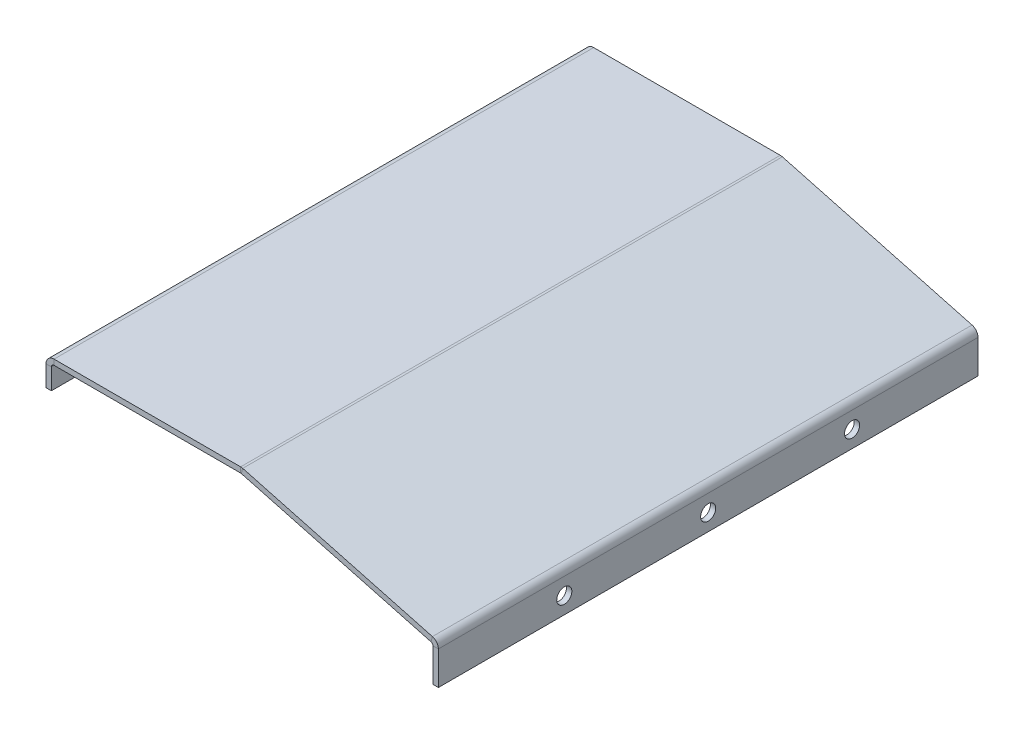
ISO-10303-21;
HEADER;
FILE_DESCRIPTION(('STEP AP214'),'2;1');
FILE_NAME('part.step','',(''),(''),'','','');
FILE_SCHEMA(('AUTOMOTIVE_DESIGN { 1 0 10303 214 1 1 1 1 }'));
ENDSEC;
DATA;
#1=APPLICATION_CONTEXT('core data for automotive mechanical design processes');
#2=APPLICATION_PROTOCOL_DEFINITION('international standard','automotive_design',2000,#1);
#3=PRODUCT_CONTEXT('',#1,'mechanical');
#4=PRODUCT('Part','Part','',(#3));
#5=PRODUCT_RELATED_PRODUCT_CATEGORY('part','',(#4));
#6=PRODUCT_DEFINITION_FORMATION('','',#4);
#7=PRODUCT_DEFINITION_CONTEXT('part definition',#1,'design');
#8=PRODUCT_DEFINITION('design','',#6,#7);
#9=PRODUCT_DEFINITION_SHAPE('','',#8);
#10=(LENGTH_UNIT() NAMED_UNIT(*) SI_UNIT(.MILLI.,.METRE.));
#11=(NAMED_UNIT(*) PLANE_ANGLE_UNIT() SI_UNIT($,.RADIAN.));
#12=(NAMED_UNIT(*) SI_UNIT($,.STERADIAN.) SOLID_ANGLE_UNIT());
#13=UNCERTAINTY_MEASURE_WITH_UNIT(LENGTH_MEASURE(1.E-05),#10,'distance_accuracy_value','');
#14=(GEOMETRIC_REPRESENTATION_CONTEXT(3) GLOBAL_UNCERTAINTY_ASSIGNED_CONTEXT((#13)) GLOBAL_UNIT_ASSIGNED_CONTEXT((#10,
#11,#12)) REPRESENTATION_CONTEXT('',''));
#15=CARTESIAN_POINT('',(0.,0.,0.));
#16=DIRECTION('',(0.,0.,1.));
#17=DIRECTION('',(1.,0.,0.));
#18=AXIS2_PLACEMENT_3D('',#15,#16,#17);
#19=CARTESIAN_POINT('',(54.5926736099192,-0.0511112605663946,150.));
#20=DIRECTION('',(0.,0.,1.));
#21=DIRECTION('',(1.,0.,0.));
#22=AXIS2_PLACEMENT_3D('',#19,#20,#21);
#23=PLANE('',#22);
#24=DIRECTION('',(0.96592582628907,-0.258819045102515,0.));
#25=VECTOR('',#24,1.);
#26=CARTESIAN_POINT('',(-2.15131707126789,13.6004809471613,150.));
#27=LINE('',#26,#25);
#28=CARTESIAN_POINT('',(107.025513428092,-15.6533626173311,150.));
#29=VERTEX_POINT('',#28);
#30=CARTESIAN_POINT('',(54.2981159211651,-1.52509903635547,150.));
#31=VERTEX_POINT('',#30);
#32=EDGE_CURVE('E350',#29,#31,#27,.F.);
#33=ORIENTED_EDGE('',*,*,#32,.F.);
#34=DIRECTION('',(0.258819045102519,0.965925826289069,0.));
#35=VECTOR('',#34,1.);
#36=CARTESIAN_POINT('',(107.025513428092,-15.6533626173311,150.));
#37=LINE('',#36,#35);
#38=CARTESIAN_POINT('',(107.413741995746,-14.2044738778975,150.));
#39=VERTEX_POINT('',#38);
#40=EDGE_CURVE('E268',#29,#39,#37,.T.);
#41=ORIENTED_EDGE('',*,*,#40,.T.);
#42=DIRECTION('',(-0.96592582628907,0.258819045102515,0.));
#43=VECTOR('',#42,1.);
#44=CARTESIAN_POINT('',(54.5926736099192,-0.0511112605663912,150.));
#45=LINE('',#44,#43);
#46=CARTESIAN_POINT('',(54.6863444888188,-0.0762102969218588,150.));
#47=VERTEX_POINT('',#46);
#48=EDGE_CURVE('E344',#39,#47,#45,.T.);
#49=ORIENTED_EDGE('',*,*,#48,.T.);
#50=DIRECTION('',(0.258819045102515,0.96592582628907,0.));
#51=VECTOR('',#50,1.);
#52=CARTESIAN_POINT('',(54.2981159211651,-1.52509903635547,150.));
#53=LINE('',#52,#51);
#54=EDGE_CURVE('E358',#31,#47,#53,.T.);
#55=ORIENTED_EDGE('',*,*,#54,.F.);
#56=EDGE_LOOP('',(#33,#41,#49,#55));
#57=FACE_BOUND('',#56,.T.);
#58=ADVANCED_FACE('F98',(#57),#23,.T.);
#59=CARTESIAN_POINT('',(-1.76308850361412,15.0493696865949,0.));
#60=DIRECTION('',(0.258819045102515,0.96592582628907,0.));
#61=DIRECTION('',(-0.96592582628907,0.258819045102515,0.));
#62=AXIS2_PLACEMENT_3D('',#59,#60,#61);
#63=PLANE('',#62);
#64=ORIENTED_EDGE('',*,*,#48,.F.);
#65=DIRECTION('',(0.,0.,1.));
#66=VECTOR('',#65,1.);
#67=CARTESIAN_POINT('',(107.413741995746,-14.2044738778975,150.));
#68=LINE('',#67,#66);
#69=CARTESIAN_POINT('',(107.413741995746,-14.2044738778974,0.));
#70=VERTEX_POINT('',#69);
#71=EDGE_CURVE('E218',#39,#70,#68,.F.);
#72=ORIENTED_EDGE('',*,*,#71,.T.);
#73=DIRECTION('',(0.96592582628907,-0.258819045102515,0.));
#74=VECTOR('',#73,1.);
#75=CARTESIAN_POINT('',(109.459695887124,-14.7526855708433,0.));
#76=LINE('',#75,#74);
#77=CARTESIAN_POINT('',(54.6863444888189,-0.076210296921861,0.));
#78=VERTEX_POINT('',#77);
#79=EDGE_CURVE('E347',#78,#70,#76,.T.);
#80=ORIENTED_EDGE('',*,*,#79,.F.);
#81=DIRECTION('',(0.,0.,1.));
#82=VECTOR('',#81,1.);
#83=CARTESIAN_POINT('',(54.6863444888189,-0.0762102969218605,0.));
#84=LINE('',#83,#82);
#85=EDGE_CURVE('E355',#78,#47,#84,.T.);
#86=ORIENTED_EDGE('',*,*,#85,.T.);
#87=EDGE_LOOP('',(#64,#72,#80,#86));
#88=FACE_BOUND('',#87,.T.);
#89=ADVANCED_FACE('F419',(#88),#63,.T.);
#90=CARTESIAN_POINT('',(-2.15131707126789,13.6004809471613,0.));
#91=DIRECTION('',(0.258819045102515,0.96592582628907,0.));
#92=DIRECTION('',(-0.96592582628907,0.258819045102515,0.));
#93=AXIS2_PLACEMENT_3D('',#90,#91,#92);
#94=PLANE('',#93);
#95=DIRECTION('',(0.,0.,1.));
#96=VECTOR('',#95,1.);
#97=CARTESIAN_POINT('',(107.025513428092,-15.6533626173311,150.));
#98=LINE('',#97,#96);
#99=CARTESIAN_POINT('',(107.025513428092,-15.6533626173311,0.));
#100=VERTEX_POINT('',#99);
#101=EDGE_CURVE('E272',#29,#100,#98,.F.);
#102=ORIENTED_EDGE('',*,*,#101,.F.);
#103=ORIENTED_EDGE('',*,*,#32,.T.);
#104=DIRECTION('',(0.,0.,-1.));
#105=VECTOR('',#104,1.);
#106=CARTESIAN_POINT('',(54.2981159211651,-1.52509903635547,0.));
#107=LINE('',#106,#105);
#108=CARTESIAN_POINT('',(54.2981159211651,-1.52509903635547,0.));
#109=VERTEX_POINT('',#108);
#110=EDGE_CURVE('E361',#109,#31,#107,.F.);
#111=ORIENTED_EDGE('',*,*,#110,.F.);
#112=DIRECTION('',(-0.96592582628907,0.258819045102515,0.));
#113=VECTOR('',#112,1.);
#114=CARTESIAN_POINT('',(-2.15131707126789,13.6004809471613,0.));
#115=LINE('',#114,#113);
#116=EDGE_CURVE('E352',#109,#100,#115,.F.);
#117=ORIENTED_EDGE('',*,*,#116,.T.);
#118=EDGE_LOOP('',(#102,#103,#111,#117));
#119=FACE_BOUND('',#118,.T.);
#120=ADVANCED_FACE('F425',(#119),#94,.F.);
#121=CARTESIAN_POINT('',(0.,-1.5,150.));
#122=DIRECTION('',(0.,1.,0.));
#123=DIRECTION('',(0.,0.,1.));
#124=AXIS2_PLACEMENT_3D('',#121,#122,#123);
#125=PLANE('',#124);
#126=DIRECTION('',(0.,0.,-1.));
#127=VECTOR('',#126,1.);
#128=CARTESIAN_POINT('',(2.2366,-1.5,0.));
#129=LINE('',#128,#127);
#130=CARTESIAN_POINT('',(2.2366,-1.5,0.));
#131=VERTEX_POINT('',#130);
#132=CARTESIAN_POINT('',(2.2366,-1.5,150.));
#133=VERTEX_POINT('',#132);
#134=EDGE_CURVE('E335',#131,#133,#129,.F.);
#135=ORIENTED_EDGE('',*,*,#134,.F.);
#136=DIRECTION('',(1.,0.,0.));
#137=VECTOR('',#136,1.);
#138=CARTESIAN_POINT('',(0.,-1.5,0.));
#139=LINE('',#138,#137);
#140=CARTESIAN_POINT('',(54.1074698125426,-1.49999999999999,0.));
#141=VERTEX_POINT('',#140);
#142=EDGE_CURVE('E387',#131,#141,#139,.T.);
#143=ORIENTED_EDGE('',*,*,#142,.T.);
#144=DIRECTION('',(0.,0.,1.));
#145=VECTOR('',#144,1.);
#146=CARTESIAN_POINT('',(54.1074698125426,-1.49999999999999,150.));
#147=LINE('',#146,#145);
#148=CARTESIAN_POINT('',(54.1074698125426,-1.49999999999999,150.));
#149=VERTEX_POINT('',#148);
#150=EDGE_CURVE('E379',#149,#141,#147,.F.);
#151=ORIENTED_EDGE('',*,*,#150,.F.);
#152=DIRECTION('',(1.,0.,0.));
#153=VECTOR('',#152,1.);
#154=CARTESIAN_POINT('',(0.,-1.5,150.));
#155=LINE('',#154,#153);
#156=EDGE_CURVE('E107',#133,#149,#155,.T.);
#157=ORIENTED_EDGE('',*,*,#156,.F.);
#158=EDGE_LOOP('',(#135,#143,#151,#157));
#159=FACE_BOUND('',#158,.T.);
#160=ADVANCED_FACE('F100',(#159),#125,.F.);
#161=CARTESIAN_POINT('',(0.,0.,150.));
#162=DIRECTION('',(0.,1.,0.));
#163=DIRECTION('',(0.,0.,1.));
#164=AXIS2_PLACEMENT_3D('',#161,#162,#163);
#165=PLANE('',#164);
#166=DIRECTION('',(1.,0.,0.));
#167=VECTOR('',#166,1.);
#168=CARTESIAN_POINT('',(0.,0.,0.));
#169=LINE('',#168,#167);
#170=CARTESIAN_POINT('',(2.2366,0.,0.));
#171=VERTEX_POINT('',#170);
#172=CARTESIAN_POINT('',(54.1074698125426,0.,0.));
#173=VERTEX_POINT('',#172);
#174=EDGE_CURVE('E123',#171,#173,#169,.T.);
#175=ORIENTED_EDGE('',*,*,#174,.F.);
#176=DIRECTION('',(0.,0.,-1.));
#177=VECTOR('',#176,1.);
#178=CARTESIAN_POINT('',(2.2366,0.,0.));
#179=LINE('',#178,#177);
#180=CARTESIAN_POINT('',(2.2366,0.,150.));
#181=VERTEX_POINT('',#180);
#182=EDGE_CURVE('E322',#171,#181,#179,.F.);
#183=ORIENTED_EDGE('',*,*,#182,.T.);
#184=DIRECTION('',(1.,0.,0.));
#185=VECTOR('',#184,1.);
#186=CARTESIAN_POINT('',(0.,0.,150.));
#187=LINE('',#186,#185);
#188=CARTESIAN_POINT('',(54.1074698125426,0.,150.));
#189=VERTEX_POINT('',#188);
#190=EDGE_CURVE('E13',#181,#189,#187,.T.);
#191=ORIENTED_EDGE('',*,*,#190,.T.);
#192=DIRECTION('',(0.,0.,1.));
#193=VECTOR('',#192,1.);
#194=CARTESIAN_POINT('',(54.1074698125426,0.,150.));
#195=LINE('',#194,#193);
#196=EDGE_CURVE('E366',#189,#173,#195,.F.);
#197=ORIENTED_EDGE('',*,*,#196,.T.);
#198=EDGE_LOOP('',(#175,#183,#191,#197));
#199=FACE_BOUND('',#198,.T.);
#200=ADVANCED_FACE('F456',(#199),#165,.T.);
#201=CARTESIAN_POINT('',(0.,0.,150.));
#202=DIRECTION('',(0.,0.,-1.));
#203=DIRECTION('',(-1.,0.,0.));
#204=AXIS2_PLACEMENT_3D('',#201,#202,#203);
#205=PLANE('',#204);
#206=DIRECTION('',(0.,1.,0.));
#207=VECTOR('',#206,1.);
#208=CARTESIAN_POINT('',(2.2366,-1.5,150.));
#209=LINE('',#208,#207);
#210=EDGE_CURVE('E339',#133,#181,#209,.T.);
#211=ORIENTED_EDGE('',*,*,#210,.F.);
#212=ORIENTED_EDGE('',*,*,#156,.T.);
#213=DIRECTION('',(0.,1.,0.));
#214=VECTOR('',#213,1.);
#215=CARTESIAN_POINT('',(54.1074698125426,-1.49999999999999,150.));
#216=LINE('',#215,#214);
#217=EDGE_CURVE('E373',#149,#189,#216,.T.);
#218=ORIENTED_EDGE('',*,*,#217,.T.);
#219=ORIENTED_EDGE('',*,*,#190,.F.);
#220=EDGE_LOOP('',(#211,#212,#218,#219));
#221=FACE_BOUND('',#220,.T.);
#222=ADVANCED_FACE('F453',(#221),#205,.F.);
#223=CARTESIAN_POINT('',(0.,0.,0.));
#224=DIRECTION('',(0.,0.,-1.));
#225=DIRECTION('',(-1.,0.,0.));
#226=AXIS2_PLACEMENT_3D('',#223,#224,#225);
#227=PLANE('',#226);
#228=ORIENTED_EDGE('',*,*,#142,.F.);
#229=DIRECTION('',(0.,1.,0.));
#230=VECTOR('',#229,1.);
#231=CARTESIAN_POINT('',(2.2366,-1.5,0.));
#232=LINE('',#231,#230);
#233=EDGE_CURVE('E329',#131,#171,#232,.T.);
#234=ORIENTED_EDGE('',*,*,#233,.T.);
#235=ORIENTED_EDGE('',*,*,#174,.T.);
#236=DIRECTION('',(0.,1.,0.));
#237=VECTOR('',#236,1.);
#238=CARTESIAN_POINT('',(54.1074698125426,-1.49999999999999,0.));
#239=LINE('',#238,#237);
#240=EDGE_CURVE('E384',#141,#173,#239,.T.);
#241=ORIENTED_EDGE('',*,*,#240,.F.);
#242=EDGE_LOOP('',(#228,#234,#235,#241));
#243=FACE_BOUND('',#242,.T.);
#244=ADVANCED_FACE('F448',(#243),#227,.T.);
#245=CARTESIAN_POINT('',(54.1074698125426,-2.23660000000001,0.));
#246=DIRECTION('',(0.,0.,-1.));
#247=DIRECTION('',(-1.,0.,0.));
#248=AXIS2_PLACEMENT_3D('',#245,#246,#247);
#249=PLANE('',#248);
#250=DIRECTION('',(0.258819045102515,0.96592582628907,0.));
#251=VECTOR('',#250,1.);
#252=CARTESIAN_POINT('',(54.6863444888188,-0.076210296921864,0.));
#253=LINE('',#252,#251);
#254=EDGE_CURVE('E342',#109,#78,#253,.T.);
#255=ORIENTED_EDGE('',*,*,#254,.F.);
#256=CARTESIAN_POINT('',(54.1074698125426,-2.23660000000001,0.));
#257=DIRECTION('',(0.,0.,1.));
#258=DIRECTION('',(1.,0.,0.));
#259=AXIS2_PLACEMENT_3D('',#256,#257,#258);
#260=CIRCLE('',#259,0.736600000000016);
#261=EDGE_CURVE('E376',#141,#109,#260,.F.);
#262=ORIENTED_EDGE('',*,*,#261,.F.);
#263=ORIENTED_EDGE('',*,*,#240,.T.);
#264=CARTESIAN_POINT('',(54.1074698125426,-2.23660000000001,0.));
#265=DIRECTION('',(0.,0.,1.));
#266=DIRECTION('',(1.,0.,0.));
#267=AXIS2_PLACEMENT_3D('',#264,#265,#266);
#268=CIRCLE('',#267,2.23660000000002);
#269=EDGE_CURVE('E369',#173,#78,#268,.F.);
#270=ORIENTED_EDGE('',*,*,#269,.T.);
#271=EDGE_LOOP('',(#255,#262,#263,#270));
#272=FACE_BOUND('',#271,.T.);
#273=ADVANCED_FACE('F445',(#272),#249,.T.);
#274=CARTESIAN_POINT('',(54.1074698125426,-2.23660000000001,150.));
#275=DIRECTION('',(0.,0.,-1.));
#276=DIRECTION('',(-1.,0.,0.));
#277=AXIS2_PLACEMENT_3D('',#274,#275,#276);
#278=PLANE('',#277);
#279=CARTESIAN_POINT('',(54.1074698125426,-2.23660000000001,150.));
#280=DIRECTION('',(0.,0.,1.));
#281=DIRECTION('',(1.,0.,0.));
#282=AXIS2_PLACEMENT_3D('',#279,#280,#281);
#283=CIRCLE('',#282,0.736600000000016);
#284=EDGE_CURVE('E346',#31,#149,#283,.T.);
#285=ORIENTED_EDGE('',*,*,#284,.F.);
#286=ORIENTED_EDGE('',*,*,#54,.T.);
#287=CARTESIAN_POINT('',(54.1074698125426,-2.23660000000001,150.));
#288=DIRECTION('',(0.,0.,1.));
#289=DIRECTION('',(1.,0.,0.));
#290=AXIS2_PLACEMENT_3D('',#287,#288,#289);
#291=CIRCLE('',#290,2.23660000000002);
#292=EDGE_CURVE('E370',#47,#189,#291,.T.);
#293=ORIENTED_EDGE('',*,*,#292,.T.);
#294=ORIENTED_EDGE('',*,*,#217,.F.);
#295=EDGE_LOOP('',(#285,#286,#293,#294));
#296=FACE_BOUND('',#295,.T.);
#297=ADVANCED_FACE('F440',(#296),#278,.F.);
#298=CARTESIAN_POINT('',(54.1074698125426,-2.23660000000001,150.));
#299=DIRECTION('',(0.,0.,1.));
#300=DIRECTION('',(0.258819045102515,0.96592582628907,0.));
#301=AXIS2_PLACEMENT_3D('',#298,#299,#300);
#302=CYLINDRICAL_SURFACE('',#301,2.23660000000002);
#303=ORIENTED_EDGE('',*,*,#196,.F.);
#304=ORIENTED_EDGE('',*,*,#292,.F.);
#305=ORIENTED_EDGE('',*,*,#85,.F.);
#306=ORIENTED_EDGE('',*,*,#269,.F.);
#307=EDGE_LOOP('',(#303,#304,#305,#306));
#308=FACE_BOUND('',#307,.T.);
#309=ADVANCED_FACE('F437',(#308),#302,.T.);
#310=CARTESIAN_POINT('',(54.1074698125426,-2.23660000000001,150.));
#311=DIRECTION('',(0.,0.,1.));
#312=DIRECTION('',(0.258819045102515,0.96592582628907,0.));
#313=AXIS2_PLACEMENT_3D('',#310,#311,#312);
#314=CYLINDRICAL_SURFACE('',#313,0.736600000000016);
#315=ORIENTED_EDGE('',*,*,#150,.T.);
#316=ORIENTED_EDGE('',*,*,#261,.T.);
#317=ORIENTED_EDGE('',*,*,#110,.T.);
#318=ORIENTED_EDGE('',*,*,#284,.T.);
#319=EDGE_LOOP('',(#315,#316,#317,#318));
#320=FACE_BOUND('',#319,.T.);
#321=ADVANCED_FACE('F435',(#320),#314,.F.);
#322=CARTESIAN_POINT('',(109.459695887124,-14.7526855708433,0.));
#323=DIRECTION('',(0.,0.,-1.));
#324=DIRECTION('',(-1.,0.,0.));
#325=AXIS2_PLACEMENT_3D('',#322,#323,#324);
#326=PLANE('',#325);
#327=DIRECTION('',(0.258819045102519,0.965925826289069,0.));
#328=VECTOR('',#327,1.);
#329=CARTESIAN_POINT('',(107.025513428092,-15.6533626173311,0.));
#330=LINE('',#329,#328);
#331=EDGE_CURVE('E275',#100,#70,#330,.T.);
#332=ORIENTED_EDGE('',*,*,#331,.F.);
#333=ORIENTED_EDGE('',*,*,#116,.F.);
#334=ORIENTED_EDGE('',*,*,#254,.T.);
#335=ORIENTED_EDGE('',*,*,#79,.T.);
#336=EDGE_LOOP('',(#332,#333,#334,#335));
#337=FACE_BOUND('',#336,.T.);
#338=ADVANCED_FACE('F431',(#337),#326,.T.);
#339=CARTESIAN_POINT('',(2.2366,-2.2366,150.));
#340=DIRECTION('',(0.,0.,1.));
#341=DIRECTION('',(1.,0.,0.));
#342=AXIS2_PLACEMENT_3D('',#339,#340,#341);
#343=PLANE('',#342);
#344=DIRECTION('',(-1.,0.,0.));
#345=VECTOR('',#344,1.);
#346=CARTESIAN_POINT('',(0.,-2.23659999999999,150.));
#347=LINE('',#346,#345);
#348=CARTESIAN_POINT('',(1.5,-2.2366,150.));
#349=VERTEX_POINT('',#348);
#350=CARTESIAN_POINT('',(0.,-2.23659999999999,150.));
#351=VERTEX_POINT('',#350);
#352=EDGE_CURVE('E319',#349,#351,#347,.T.);
#353=ORIENTED_EDGE('',*,*,#352,.F.);
#354=CARTESIAN_POINT('',(2.2366,-2.2366,150.));
#355=DIRECTION('',(0.,0.,-1.));
#356=DIRECTION('',(-1.,0.,0.));
#357=AXIS2_PLACEMENT_3D('',#354,#355,#356);
#358=CIRCLE('',#357,0.7366);
#359=EDGE_CURVE('E332',#133,#349,#358,.F.);
#360=ORIENTED_EDGE('',*,*,#359,.F.);
#361=ORIENTED_EDGE('',*,*,#210,.T.);
#362=CARTESIAN_POINT('',(2.2366,-2.2366,150.));
#363=DIRECTION('',(0.,0.,-1.));
#364=DIRECTION('',(-1.,0.,0.));
#365=AXIS2_PLACEMENT_3D('',#362,#363,#364);
#366=CIRCLE('',#365,2.2366);
#367=EDGE_CURVE('E325',#181,#351,#366,.F.);
#368=ORIENTED_EDGE('',*,*,#367,.T.);
#369=EDGE_LOOP('',(#353,#360,#361,#368));
#370=FACE_BOUND('',#369,.T.);
#371=ADVANCED_FACE('F434',(#370),#343,.T.);
#372=CARTESIAN_POINT('',(2.2366,-2.2366,0.));
#373=DIRECTION('',(0.,0.,1.));
#374=DIRECTION('',(1.,0.,0.));
#375=AXIS2_PLACEMENT_3D('',#372,#373,#374);
#376=PLANE('',#375);
#377=CARTESIAN_POINT('',(2.2366,-2.2366,0.));
#378=DIRECTION('',(0.,0.,-1.));
#379=DIRECTION('',(-1.,0.,0.));
#380=AXIS2_PLACEMENT_3D('',#377,#378,#379);
#381=CIRCLE('',#380,0.7366);
#382=CARTESIAN_POINT('',(1.5,-2.2366,0.));
#383=VERTEX_POINT('',#382);
#384=EDGE_CURVE('E291',#383,#131,#381,.T.);
#385=ORIENTED_EDGE('',*,*,#384,.F.);
#386=DIRECTION('',(-1.,0.,0.));
#387=VECTOR('',#386,1.);
#388=CARTESIAN_POINT('',(1.5,-2.2366,0.));
#389=LINE('',#388,#387);
#390=CARTESIAN_POINT('',(0.,-2.23659999999999,0.));
#391=VERTEX_POINT('',#390);
#392=EDGE_CURVE('E314',#383,#391,#389,.T.);
#393=ORIENTED_EDGE('',*,*,#392,.T.);
#394=CARTESIAN_POINT('',(2.2366,-2.2366,0.));
#395=DIRECTION('',(0.,0.,-1.));
#396=DIRECTION('',(-1.,0.,0.));
#397=AXIS2_PLACEMENT_3D('',#394,#395,#396);
#398=CIRCLE('',#397,2.2366);
#399=EDGE_CURVE('E326',#391,#171,#398,.T.);
#400=ORIENTED_EDGE('',*,*,#399,.T.);
#401=ORIENTED_EDGE('',*,*,#233,.F.);
#402=EDGE_LOOP('',(#385,#393,#400,#401));
#403=FACE_BOUND('',#402,.T.);
#404=ADVANCED_FACE('F480',(#403),#376,.F.);
#405=CARTESIAN_POINT('',(2.2366,-2.2366,0.));
#406=DIRECTION('',(0.,0.,-1.));
#407=DIRECTION('',(-1.,0.,0.));
#408=AXIS2_PLACEMENT_3D('',#405,#406,#407);
#409=CYLINDRICAL_SURFACE('',#408,2.2366);
#410=ORIENTED_EDGE('',*,*,#182,.F.);
#411=ORIENTED_EDGE('',*,*,#399,.F.);
#412=DIRECTION('',(0.,0.,-1.));
#413=VECTOR('',#412,1.);
#414=CARTESIAN_POINT('',(0.,-2.23659999999999,0.));
#415=LINE('',#414,#413);
#416=EDGE_CURVE('E311',#351,#391,#415,.T.);
#417=ORIENTED_EDGE('',*,*,#416,.F.);
#418=ORIENTED_EDGE('',*,*,#367,.F.);
#419=EDGE_LOOP('',(#410,#411,#417,#418));
#420=FACE_BOUND('',#419,.T.);
#421=ADVANCED_FACE('F503',(#420),#409,.T.);
#422=CARTESIAN_POINT('',(2.2366,-2.2366,0.));
#423=DIRECTION('',(0.,0.,-1.));
#424=DIRECTION('',(-1.,0.,0.));
#425=AXIS2_PLACEMENT_3D('',#422,#423,#424);
#426=CYLINDRICAL_SURFACE('',#425,0.7366);
#427=ORIENTED_EDGE('',*,*,#134,.T.);
#428=ORIENTED_EDGE('',*,*,#359,.T.);
#429=DIRECTION('',(0.,0.,1.));
#430=VECTOR('',#429,1.);
#431=CARTESIAN_POINT('',(1.5,-2.2366,150.));
#432=LINE('',#431,#430);
#433=EDGE_CURVE('E317',#349,#383,#432,.F.);
#434=ORIENTED_EDGE('',*,*,#433,.T.);
#435=ORIENTED_EDGE('',*,*,#384,.T.);
#436=EDGE_LOOP('',(#427,#428,#434,#435));
#437=FACE_BOUND('',#436,.T.);
#438=ADVANCED_FACE('F482',(#437),#426,.F.);
#439=CARTESIAN_POINT('',(0.,-1.49999999999999,0.));
#440=DIRECTION('',(0.,0.,-1.));
#441=DIRECTION('',(-1.,0.,0.));
#442=AXIS2_PLACEMENT_3D('',#439,#440,#441);
#443=PLANE('',#442);
#444=DIRECTION('',(0.,1.,0.));
#445=VECTOR('',#444,1.);
#446=CARTESIAN_POINT('',(0.,-1.49999999999999,0.));
#447=LINE('',#446,#445);
#448=CARTESIAN_POINT('',(0.,-8.,0.));
#449=VERTEX_POINT('',#448);
#450=EDGE_CURVE('E295',#449,#391,#447,.T.);
#451=ORIENTED_EDGE('',*,*,#450,.T.);
#452=ORIENTED_EDGE('',*,*,#392,.F.);
#453=DIRECTION('',(0.,-1.,0.));
#454=VECTOR('',#453,1.);
#455=CARTESIAN_POINT('',(1.50000000000001,0.,0.));
#456=LINE('',#455,#454);
#457=CARTESIAN_POINT('',(1.49999999999998,-8.00000000000001,0.));
#458=VERTEX_POINT('',#457);
#459=EDGE_CURVE('E303',#458,#383,#456,.F.);
#460=ORIENTED_EDGE('',*,*,#459,.F.);
#461=DIRECTION('',(1.,0.,0.));
#462=VECTOR('',#461,1.);
#463=CARTESIAN_POINT('',(0.,-8.,0.));
#464=LINE('',#463,#462);
#465=EDGE_CURVE('E289',#449,#458,#464,.T.);
#466=ORIENTED_EDGE('',*,*,#465,.F.);
#467=EDGE_LOOP('',(#451,#452,#460,#466));
#468=FACE_BOUND('',#467,.T.);
#469=ADVANCED_FACE('F498',(#468),#443,.T.);
#470=CARTESIAN_POINT('',(0.,-8.,150.));
#471=DIRECTION('',(0.,0.,1.));
#472=DIRECTION('',(1.,0.,0.));
#473=AXIS2_PLACEMENT_3D('',#470,#471,#472);
#474=PLANE('',#473);
#475=DIRECTION('',(0.,1.,0.));
#476=VECTOR('',#475,1.);
#477=CARTESIAN_POINT('',(1.50000000000001,0.,150.));
#478=LINE('',#477,#476);
#479=CARTESIAN_POINT('',(1.49999999999998,-8.00000000000001,150.));
#480=VERTEX_POINT('',#479);
#481=EDGE_CURVE('E309',#349,#480,#478,.F.);
#482=ORIENTED_EDGE('',*,*,#481,.F.);
#483=ORIENTED_EDGE('',*,*,#352,.T.);
#484=DIRECTION('',(0.,-1.,0.));
#485=VECTOR('',#484,1.);
#486=CARTESIAN_POINT('',(0.,-8.,150.));
#487=LINE('',#486,#485);
#488=CARTESIAN_POINT('',(0.,-8.,150.));
#489=VERTEX_POINT('',#488);
#490=EDGE_CURVE('E301',#351,#489,#487,.T.);
#491=ORIENTED_EDGE('',*,*,#490,.T.);
#492=DIRECTION('',(1.,0.,0.));
#493=VECTOR('',#492,1.);
#494=CARTESIAN_POINT('',(0.,-8.,150.));
#495=LINE('',#494,#493);
#496=EDGE_CURVE('E292',#489,#480,#495,.T.);
#497=ORIENTED_EDGE('',*,*,#496,.T.);
#498=EDGE_LOOP('',(#482,#483,#491,#497));
#499=FACE_BOUND('',#498,.T.);
#500=ADVANCED_FACE('F490',(#499),#474,.T.);
#501=CARTESIAN_POINT('',(0.,0.,0.));
#502=DIRECTION('',(-1.,0.,0.));
#503=DIRECTION('',(0.,-1.,0.));
#504=AXIS2_PLACEMENT_3D('',#501,#502,#503);
#505=PLANE('',#504);
#506=CARTESIAN_POINT('',(0.,-4.99999999999995,75.));
#507=DIRECTION('',(-1.,0.,0.));
#508=DIRECTION('',(0.,-1.,0.));
#509=AXIS2_PLACEMENT_3D('',#506,#507,#508);
#510=CIRCLE('',#509,2.1);
#511=CARTESIAN_POINT('',(0.,-7.09999999999996,75.));
#512=VERTEX_POINT('',#511);
#513=EDGE_CURVE('E279',#512,#512,#510,.T.);
#514=ORIENTED_EDGE('',*,*,#513,.F.);
#515=EDGE_LOOP('',(#514));
#516=FACE_BOUND('',#515,.T.);
#517=CARTESIAN_POINT('',(0.,-4.99999999999995,115.));
#518=DIRECTION('',(-1.,0.,0.));
#519=DIRECTION('',(0.,1.,0.));
#520=AXIS2_PLACEMENT_3D('',#517,#518,#519);
#521=CIRCLE('',#520,2.1);
#522=CARTESIAN_POINT('',(0.,-2.89999999999995,115.));
#523=VERTEX_POINT('',#522);
#524=EDGE_CURVE('E277',#523,#523,#521,.T.);
#525=ORIENTED_EDGE('',*,*,#524,.F.);
#526=EDGE_LOOP('',(#525));
#527=FACE_BOUND('',#526,.T.);
#528=CARTESIAN_POINT('',(0.,-4.99999999999995,35.));
#529=DIRECTION('',(-1.,0.,0.));
#530=DIRECTION('',(0.,-1.,0.));
#531=AXIS2_PLACEMENT_3D('',#528,#529,#530);
#532=CIRCLE('',#531,2.1);
#533=CARTESIAN_POINT('',(0.,-7.09999999999995,35.));
#534=VERTEX_POINT('',#533);
#535=EDGE_CURVE('E285',#534,#534,#532,.T.);
#536=ORIENTED_EDGE('',*,*,#535,.F.);
#537=EDGE_LOOP('',(#536));
#538=FACE_BOUND('',#537,.T.);
#539=ORIENTED_EDGE('',*,*,#490,.F.);
#540=ORIENTED_EDGE('',*,*,#416,.T.);
#541=ORIENTED_EDGE('',*,*,#450,.F.);
#542=DIRECTION('',(0.,0.,-1.));
#543=VECTOR('',#542,1.);
#544=CARTESIAN_POINT('',(0.,-8.,0.));
#545=LINE('',#544,#543);
#546=EDGE_CURVE('E298',#489,#449,#545,.T.);
#547=ORIENTED_EDGE('',*,*,#546,.F.);
#548=EDGE_LOOP('',(#539,#540,#541,#547));
#549=FACE_BOUND('',#548,.T.);
#550=ADVANCED_FACE('F501',(#516,#527,#538,#549),#505,.T.);
#551=CARTESIAN_POINT('',(1.50000000000001,0.,0.));
#552=DIRECTION('',(-1.,0.,0.));
#553=DIRECTION('',(0.,-1.,0.));
#554=AXIS2_PLACEMENT_3D('',#551,#552,#553);
#555=PLANE('',#554);
#556=CARTESIAN_POINT('',(1.49999999999999,-4.99999999999996,75.));
#557=DIRECTION('',(-1.,0.,0.));
#558=DIRECTION('',(0.,-1.,0.));
#559=AXIS2_PLACEMENT_3D('',#556,#557,#558);
#560=CIRCLE('',#559,2.1);
#561=CARTESIAN_POINT('',(1.49999999999998,-7.09999999999996,75.));
#562=VERTEX_POINT('',#561);
#563=EDGE_CURVE('E102',#562,#562,#560,.T.);
#564=ORIENTED_EDGE('',*,*,#563,.T.);
#565=EDGE_LOOP('',(#564));
#566=FACE_BOUND('',#565,.T.);
#567=CARTESIAN_POINT('',(1.49999999999999,-4.99999999999996,115.));
#568=DIRECTION('',(-1.,0.,0.));
#569=DIRECTION('',(0.,-1.,0.));
#570=AXIS2_PLACEMENT_3D('',#567,#568,#569);
#571=CIRCLE('',#570,2.1);
#572=CARTESIAN_POINT('',(1.49999999999998,-7.09999999999996,115.));
#573=VERTEX_POINT('',#572);
#574=EDGE_CURVE('E282',#573,#573,#571,.T.);
#575=ORIENTED_EDGE('',*,*,#574,.T.);
#576=EDGE_LOOP('',(#575));
#577=FACE_BOUND('',#576,.T.);
#578=CARTESIAN_POINT('',(1.49999999999999,-4.99999999999996,35.));
#579=DIRECTION('',(-1.,0.,0.));
#580=DIRECTION('',(0.,-1.,0.));
#581=AXIS2_PLACEMENT_3D('',#578,#579,#580);
#582=CIRCLE('',#581,2.1);
#583=CARTESIAN_POINT('',(1.49999999999998,-7.09999999999996,35.));
#584=VERTEX_POINT('',#583);
#585=EDGE_CURVE('E288',#584,#584,#582,.T.);
#586=ORIENTED_EDGE('',*,*,#585,.T.);
#587=EDGE_LOOP('',(#586));
#588=FACE_BOUND('',#587,.T.);
#589=ORIENTED_EDGE('',*,*,#433,.F.);
#590=ORIENTED_EDGE('',*,*,#481,.T.);
#591=DIRECTION('',(0.,0.,1.));
#592=VECTOR('',#591,1.);
#593=CARTESIAN_POINT('',(1.49999999999998,-8.00000000000001,0.));
#594=LINE('',#593,#592);
#595=EDGE_CURVE('E306',#480,#458,#594,.F.);
#596=ORIENTED_EDGE('',*,*,#595,.T.);
#597=ORIENTED_EDGE('',*,*,#459,.T.);
#598=EDGE_LOOP('',(#589,#590,#596,#597));
#599=FACE_BOUND('',#598,.T.);
#600=ADVANCED_FACE('F400',(#566,#577,#588,#599),#555,.F.);
#601=CARTESIAN_POINT('',(0.,-8.,0.));
#602=DIRECTION('',(0.,-1.,0.));
#603=DIRECTION('',(1.,0.,0.));
#604=AXIS2_PLACEMENT_3D('',#601,#602,#603);
#605=PLANE('',#604);
#606=ORIENTED_EDGE('',*,*,#595,.F.);
#607=ORIENTED_EDGE('',*,*,#496,.F.);
#608=ORIENTED_EDGE('',*,*,#546,.T.);
#609=ORIENTED_EDGE('',*,*,#465,.T.);
#610=EDGE_LOOP('',(#606,#607,#608,#609));
#611=FACE_BOUND('',#610,.T.);
#612=ADVANCED_FACE('F496',(#611),#605,.T.);
#613=CARTESIAN_POINT('',(9.99999999999998,-4.99999999999999,35.));
#614=DIRECTION('',(-1.,0.,0.));
#615=DIRECTION('',(0.,-1.,0.));
#616=AXIS2_PLACEMENT_3D('',#613,#614,#615);
#617=CYLINDRICAL_SURFACE('',#616,2.1);
#618=ORIENTED_EDGE('',*,*,#535,.T.);
#619=EDGE_LOOP('',(#618));
#620=FACE_BOUND('',#619,.T.);
#621=ORIENTED_EDGE('',*,*,#585,.F.);
#622=EDGE_LOOP('',(#621));
#623=FACE_BOUND('',#622,.T.);
#624=ADVANCED_FACE('F414',(#620,#623),#617,.F.);
#625=CARTESIAN_POINT('',(9.99999999999998,-4.99999999999999,115.));
#626=DIRECTION('',(-1.,0.,0.));
#627=DIRECTION('',(0.,-1.,0.));
#628=AXIS2_PLACEMENT_3D('',#625,#626,#627);
#629=CYLINDRICAL_SURFACE('',#628,2.1);
#630=ORIENTED_EDGE('',*,*,#524,.T.);
#631=EDGE_LOOP('',(#630));
#632=FACE_BOUND('',#631,.T.);
#633=ORIENTED_EDGE('',*,*,#574,.F.);
#634=EDGE_LOOP('',(#633));
#635=FACE_BOUND('',#634,.T.);
#636=ADVANCED_FACE('F405',(#632,#635),#629,.F.);
#637=CARTESIAN_POINT('',(9.99999999999998,-4.99999999999999,75.));
#638=DIRECTION('',(-1.,0.,0.));
#639=DIRECTION('',(0.,-1.,0.));
#640=AXIS2_PLACEMENT_3D('',#637,#638,#639);
#641=CYLINDRICAL_SURFACE('',#640,2.1);
#642=ORIENTED_EDGE('',*,*,#513,.T.);
#643=EDGE_LOOP('',(#642));
#644=FACE_BOUND('',#643,.T.);
#645=ORIENTED_EDGE('',*,*,#563,.F.);
#646=EDGE_LOOP('',(#645));
#647=FACE_BOUND('',#646,.T.);
#648=ADVANCED_FACE('F402',(#644,#647),#641,.F.);
#649=CARTESIAN_POINT('',(106.83486731947,-16.3648635809756,0.));
#650=DIRECTION('',(0.,0.,-1.));
#651=DIRECTION('',(-1.,0.,0.));
#652=AXIS2_PLACEMENT_3D('',#649,#650,#651);
#653=PLANE('',#652);
#654=DIRECTION('',(1.,0.,0.));
#655=VECTOR('',#654,1.);
#656=CARTESIAN_POINT('',(109.07146731947,-16.3648635809756,0.));
#657=LINE('',#656,#655);
#658=CARTESIAN_POINT('',(107.57146731947,-16.3648635809756,0.));
#659=VERTEX_POINT('',#658);
#660=CARTESIAN_POINT('',(109.07146731947,-16.3648635809756,0.));
#661=VERTEX_POINT('',#660);
#662=EDGE_CURVE('E263',#659,#661,#657,.T.);
#663=ORIENTED_EDGE('',*,*,#662,.F.);
#664=CARTESIAN_POINT('',(106.83486731947,-16.3648635809756,0.));
#665=DIRECTION('',(0.,0.,1.));
#666=DIRECTION('',(1.,0.,0.));
#667=AXIS2_PLACEMENT_3D('',#664,#665,#666);
#668=CIRCLE('',#667,0.736600000000004);
#669=EDGE_CURVE('E221',#100,#659,#668,.F.);
#670=ORIENTED_EDGE('',*,*,#669,.F.);
#671=ORIENTED_EDGE('',*,*,#331,.T.);
#672=CARTESIAN_POINT('',(106.83486731947,-16.3648635809756,0.));
#673=DIRECTION('',(0.,0.,1.));
#674=DIRECTION('',(1.,0.,0.));
#675=AXIS2_PLACEMENT_3D('',#672,#673,#674);
#676=CIRCLE('',#675,2.2366);
#677=EDGE_CURVE('E115',#70,#661,#676,.F.);
#678=ORIENTED_EDGE('',*,*,#677,.T.);
#679=EDGE_LOOP('',(#663,#670,#671,#678));
#680=FACE_BOUND('',#679,.T.);
#681=ADVANCED_FACE('F404',(#680),#653,.T.);
#682=CARTESIAN_POINT('',(106.83486731947,-16.3648635809756,150.));
#683=DIRECTION('',(0.,0.,-1.));
#684=DIRECTION('',(-1.,0.,0.));
#685=AXIS2_PLACEMENT_3D('',#682,#683,#684);
#686=PLANE('',#685);
#687=CARTESIAN_POINT('',(106.83486731947,-16.3648635809756,150.));
#688=DIRECTION('',(0.,0.,1.));
#689=DIRECTION('',(1.,0.,0.));
#690=AXIS2_PLACEMENT_3D('',#687,#688,#689);
#691=CIRCLE('',#690,0.736600000000004);
#692=CARTESIAN_POINT('',(107.57146731947,-16.3648635809756,150.));
#693=VERTEX_POINT('',#692);
#694=EDGE_CURVE('E228',#693,#29,#691,.T.);
#695=ORIENTED_EDGE('',*,*,#694,.F.);
#696=DIRECTION('',(1.,0.,0.));
#697=VECTOR('',#696,1.);
#698=CARTESIAN_POINT('',(107.57146731947,-16.3648635809756,150.));
#699=LINE('',#698,#697);
#700=CARTESIAN_POINT('',(109.07146731947,-16.3648635809756,150.));
#701=VERTEX_POINT('',#700);
#702=EDGE_CURVE('E225',#693,#701,#699,.T.);
#703=ORIENTED_EDGE('',*,*,#702,.T.);
#704=CARTESIAN_POINT('',(106.83486731947,-16.3648635809756,150.));
#705=DIRECTION('',(0.,0.,1.));
#706=DIRECTION('',(1.,0.,0.));
#707=AXIS2_PLACEMENT_3D('',#704,#705,#706);
#708=CIRCLE('',#707,2.2366);
#709=EDGE_CURVE('E212',#701,#39,#708,.T.);
#710=ORIENTED_EDGE('',*,*,#709,.T.);
#711=ORIENTED_EDGE('',*,*,#40,.F.);
#712=EDGE_LOOP('',(#695,#703,#710,#711));
#713=FACE_BOUND('',#712,.T.);
#714=ADVANCED_FACE('F226',(#713),#686,.F.);
#715=CARTESIAN_POINT('',(106.83486731947,-16.3648635809756,150.));
#716=DIRECTION('',(0.,0.,1.));
#717=DIRECTION('',(1.,0.,0.));
#718=AXIS2_PLACEMENT_3D('',#715,#716,#717);
#719=CYLINDRICAL_SURFACE('',#718,2.2366);
#720=ORIENTED_EDGE('',*,*,#71,.F.);
#721=ORIENTED_EDGE('',*,*,#709,.F.);
#722=DIRECTION('',(0.,0.,1.));
#723=VECTOR('',#722,1.);
#724=CARTESIAN_POINT('',(109.07146731947,-16.3648635809756,0.));
#725=LINE('',#724,#723);
#726=EDGE_CURVE('E216',#661,#701,#725,.T.);
#727=ORIENTED_EDGE('',*,*,#726,.F.);
#728=ORIENTED_EDGE('',*,*,#677,.F.);
#729=EDGE_LOOP('',(#720,#721,#727,#728));
#730=FACE_BOUND('',#729,.T.);
#731=ADVANCED_FACE('F214',(#730),#719,.T.);
#732=CARTESIAN_POINT('',(106.83486731947,-16.3648635809756,150.));
#733=DIRECTION('',(0.,0.,1.));
#734=DIRECTION('',(1.,0.,0.));
#735=AXIS2_PLACEMENT_3D('',#732,#733,#734);
#736=CYLINDRICAL_SURFACE('',#735,0.736600000000004);
#737=ORIENTED_EDGE('',*,*,#101,.T.);
#738=ORIENTED_EDGE('',*,*,#669,.T.);
#739=DIRECTION('',(0.,0.,-1.));
#740=VECTOR('',#739,1.);
#741=CARTESIAN_POINT('',(107.57146731947,-16.3648635809756,0.));
#742=LINE('',#741,#740);
#743=EDGE_CURVE('E233',#659,#693,#742,.F.);
#744=ORIENTED_EDGE('',*,*,#743,.T.);
#745=ORIENTED_EDGE('',*,*,#694,.T.);
#746=EDGE_LOOP('',(#737,#738,#744,#745));
#747=FACE_BOUND('',#746,.T.);
#748=ADVANCED_FACE('F600',(#747),#736,.F.);
#749=CARTESIAN_POINT('',(109.07146731947,-15.7996505216302,150.));
#750=DIRECTION('',(0.,0.,1.));
#751=DIRECTION('',(0.,-1.,0.));
#752=AXIS2_PLACEMENT_3D('',#749,#750,#751);
#753=PLANE('',#752);
#754=DIRECTION('',(0.,1.,0.));
#755=VECTOR('',#754,1.);
#756=CARTESIAN_POINT('',(109.07146731947,-15.7996505216302,150.));
#757=LINE('',#756,#755);
#758=CARTESIAN_POINT('',(109.07146731947,-25.6486600396618,150.));
#759=VERTEX_POINT('',#758);
#760=EDGE_CURVE('E240',#759,#701,#757,.T.);
#761=ORIENTED_EDGE('',*,*,#760,.T.);
#762=ORIENTED_EDGE('',*,*,#702,.F.);
#763=DIRECTION('',(0.,-1.,0.));
#764=VECTOR('',#763,1.);
#765=CARTESIAN_POINT('',(107.57146731947,0.401923788647328,150.));
#766=LINE('',#765,#764);
#767=CARTESIAN_POINT('',(107.57146731947,-25.6486600396618,150.));
#768=VERTEX_POINT('',#767);
#769=EDGE_CURVE('E256',#768,#693,#766,.F.);
#770=ORIENTED_EDGE('',*,*,#769,.F.);
#771=DIRECTION('',(-1.,0.,0.));
#772=VECTOR('',#771,1.);
#773=CARTESIAN_POINT('',(109.07146731947,-25.6486600396618,150.));
#774=LINE('',#773,#772);
#775=EDGE_CURVE('E245',#759,#768,#774,.T.);
#776=ORIENTED_EDGE('',*,*,#775,.F.);
#777=EDGE_LOOP('',(#761,#762,#770,#776));
#778=FACE_BOUND('',#777,.T.);
#779=ADVANCED_FACE('F244',(#778),#753,.T.);
#780=CARTESIAN_POINT('',(109.07146731947,-25.6486600396618,0.));
#781=DIRECTION('',(0.,0.,-1.));
#782=DIRECTION('',(0.,1.,0.));
#783=AXIS2_PLACEMENT_3D('',#780,#781,#782);
#784=PLANE('',#783);
#785=DIRECTION('',(0.,1.,0.));
#786=VECTOR('',#785,1.);
#787=CARTESIAN_POINT('',(107.57146731947,0.401923788647751,0.));
#788=LINE('',#787,#786);
#789=CARTESIAN_POINT('',(107.57146731947,-25.6486600396618,0.));
#790=VERTEX_POINT('',#789);
#791=EDGE_CURVE('E242',#659,#790,#788,.F.);
#792=ORIENTED_EDGE('',*,*,#791,.F.);
#793=ORIENTED_EDGE('',*,*,#662,.T.);
#794=DIRECTION('',(0.,-1.,0.));
#795=VECTOR('',#794,1.);
#796=CARTESIAN_POINT('',(109.07146731947,-25.6486600396618,0.));
#797=LINE('',#796,#795);
#798=CARTESIAN_POINT('',(109.07146731947,-25.6486600396618,0.));
#799=VERTEX_POINT('',#798);
#800=EDGE_CURVE('E241',#661,#799,#797,.T.);
#801=ORIENTED_EDGE('',*,*,#800,.T.);
#802=DIRECTION('',(-1.,0.,0.));
#803=VECTOR('',#802,1.);
#804=CARTESIAN_POINT('',(109.07146731947,-25.6486600396618,0.));
#805=LINE('',#804,#803);
#806=EDGE_CURVE('E247',#799,#790,#805,.T.);
#807=ORIENTED_EDGE('',*,*,#806,.T.);
#808=EDGE_LOOP('',(#792,#793,#801,#807));
#809=FACE_BOUND('',#808,.T.);
#810=ADVANCED_FACE('F620',(#809),#784,.T.);
#811=CARTESIAN_POINT('',(109.07146731947,0.401923788647766,0.));
#812=DIRECTION('',(1.,0.,0.));
#813=DIRECTION('',(0.,1.,0.));
#814=AXIS2_PLACEMENT_3D('',#811,#812,#813);
#815=PLANE('',#814);
#816=CARTESIAN_POINT('',(109.07146731947,-21.0067618103187,75.));
#817=DIRECTION('',(1.,0.,0.));
#818=DIRECTION('',(0.,1.,0.));
#819=AXIS2_PLACEMENT_3D('',#816,#817,#818);
#820=CIRCLE('',#819,2.1);
#821=CARTESIAN_POINT('',(109.07146731947,-18.9067618103187,75.));
#822=VERTEX_POINT('',#821);
#823=EDGE_CURVE('E715',#822,#822,#820,.T.);
#824=ORIENTED_EDGE('',*,*,#823,.F.);
#825=EDGE_LOOP('',(#824));
#826=FACE_BOUND('',#825,.T.);
#827=CARTESIAN_POINT('',(109.07146731947,-21.0067618103187,115.));
#828=DIRECTION('',(1.,0.,0.));
#829=DIRECTION('',(0.,1.,0.));
#830=AXIS2_PLACEMENT_3D('',#827,#828,#829);
#831=CIRCLE('',#830,2.1);
#832=CARTESIAN_POINT('',(109.07146731947,-18.9067618103187,115.));
#833=VERTEX_POINT('',#832);
#834=EDGE_CURVE('E719',#833,#833,#831,.T.);
#835=ORIENTED_EDGE('',*,*,#834,.F.);
#836=EDGE_LOOP('',(#835));
#837=FACE_BOUND('',#836,.T.);
#838=CARTESIAN_POINT('',(109.07146731947,-21.0067618103187,35.));
#839=DIRECTION('',(1.,0.,0.));
#840=DIRECTION('',(0.,1.,0.));
#841=AXIS2_PLACEMENT_3D('',#838,#839,#840);
#842=CIRCLE('',#841,2.1);
#843=CARTESIAN_POINT('',(109.07146731947,-18.9067618103187,35.));
#844=VERTEX_POINT('',#843);
#845=EDGE_CURVE('E266',#844,#844,#842,.T.);
#846=ORIENTED_EDGE('',*,*,#845,.F.);
#847=EDGE_LOOP('',(#846));
#848=FACE_BOUND('',#847,.T.);
#849=ORIENTED_EDGE('',*,*,#800,.F.);
#850=ORIENTED_EDGE('',*,*,#726,.T.);
#851=ORIENTED_EDGE('',*,*,#760,.F.);
#852=DIRECTION('',(0.,0.,1.));
#853=VECTOR('',#852,1.);
#854=CARTESIAN_POINT('',(109.07146731947,-25.6486600396618,150.));
#855=LINE('',#854,#853);
#856=EDGE_CURVE('E248',#799,#759,#855,.T.);
#857=ORIENTED_EDGE('',*,*,#856,.F.);
#858=EDGE_LOOP('',(#849,#850,#851,#857));
#859=FACE_BOUND('',#858,.T.);
#860=ADVANCED_FACE('F238',(#826,#837,#848,#859),#815,.T.);
#861=CARTESIAN_POINT('',(107.57146731947,0.401923788647751,0.));
#862=DIRECTION('',(1.,0.,0.));
#863=DIRECTION('',(0.,1.,0.));
#864=AXIS2_PLACEMENT_3D('',#861,#862,#863);
#865=PLANE('',#864);
#866=CARTESIAN_POINT('',(107.57146731947,-21.0067618103187,75.));
#867=DIRECTION('',(-1.,0.,0.));
#868=DIRECTION('',(0.,-1.,0.));
#869=AXIS2_PLACEMENT_3D('',#866,#867,#868);
#870=CIRCLE('',#869,2.1);
#871=CARTESIAN_POINT('',(107.57146731947,-23.1067618103187,75.));
#872=VERTEX_POINT('',#871);
#873=EDGE_CURVE('E718',#872,#872,#870,.T.);
#874=ORIENTED_EDGE('',*,*,#873,.F.);
#875=EDGE_LOOP('',(#874));
#876=FACE_BOUND('',#875,.T.);
#877=CARTESIAN_POINT('',(107.57146731947,-21.0067618103187,115.));
#878=DIRECTION('',(-1.,0.,0.));
#879=DIRECTION('',(0.,1.,0.));
#880=AXIS2_PLACEMENT_3D('',#877,#878,#879);
#881=CIRCLE('',#880,2.1);
#882=CARTESIAN_POINT('',(107.57146731947,-18.9067618103187,115.));
#883=VERTEX_POINT('',#882);
#884=EDGE_CURVE('E720',#883,#883,#881,.T.);
#885=ORIENTED_EDGE('',*,*,#884,.F.);
#886=EDGE_LOOP('',(#885));
#887=FACE_BOUND('',#886,.T.);
#888=CARTESIAN_POINT('',(107.57146731947,-21.0067618103187,35.));
#889=DIRECTION('',(-1.,0.,0.));
#890=DIRECTION('',(0.,-1.,0.));
#891=AXIS2_PLACEMENT_3D('',#888,#889,#890);
#892=CIRCLE('',#891,2.1);
#893=CARTESIAN_POINT('',(107.57146731947,-23.1067618103187,35.));
#894=VERTEX_POINT('',#893);
#895=EDGE_CURVE('E728',#894,#894,#892,.T.);
#896=ORIENTED_EDGE('',*,*,#895,.F.);
#897=EDGE_LOOP('',(#896));
#898=FACE_BOUND('',#897,.T.);
#899=ORIENTED_EDGE('',*,*,#743,.F.);
#900=ORIENTED_EDGE('',*,*,#791,.T.);
#901=DIRECTION('',(0.,0.,-1.));
#902=VECTOR('',#901,1.);
#903=CARTESIAN_POINT('',(107.57146731947,-25.6486600396618,0.));
#904=LINE('',#903,#902);
#905=EDGE_CURVE('E258',#790,#768,#904,.F.);
#906=ORIENTED_EDGE('',*,*,#905,.T.);
#907=ORIENTED_EDGE('',*,*,#769,.T.);
#908=EDGE_LOOP('',(#899,#900,#906,#907));
#909=FACE_BOUND('',#908,.T.);
#910=ADVANCED_FACE('F644',(#876,#887,#898,#909),#865,.F.);
#911=CARTESIAN_POINT('',(109.07146731947,-25.6486600396618,150.));
#912=DIRECTION('',(0.,-1.,0.));
#913=DIRECTION('',(1.,0.,0.));
#914=AXIS2_PLACEMENT_3D('',#911,#912,#913);
#915=PLANE('',#914);
#916=ORIENTED_EDGE('',*,*,#905,.F.);
#917=ORIENTED_EDGE('',*,*,#806,.F.);
#918=ORIENTED_EDGE('',*,*,#856,.T.);
#919=ORIENTED_EDGE('',*,*,#775,.T.);
#920=EDGE_LOOP('',(#916,#917,#918,#919));
#921=FACE_BOUND('',#920,.T.);
#922=ADVANCED_FACE('F638',(#921),#915,.T.);
#923=CARTESIAN_POINT('',(127.57146731947,-21.0067618103185,35.));
#924=DIRECTION('',(-1.,0.,0.));
#925=DIRECTION('',(0.,-1.,0.));
#926=AXIS2_PLACEMENT_3D('',#923,#924,#925);
#927=CYLINDRICAL_SURFACE('',#926,2.1);
#928=ORIENTED_EDGE('',*,*,#845,.T.);
#929=EDGE_LOOP('',(#928));
#930=FACE_BOUND('',#929,.T.);
#931=ORIENTED_EDGE('',*,*,#895,.T.);
#932=EDGE_LOOP('',(#931));
#933=FACE_BOUND('',#932,.T.);
#934=ADVANCED_FACE('F643',(#930,#933),#927,.F.);
#935=CARTESIAN_POINT('',(127.57146731947,-21.0067618103185,115.));
#936=DIRECTION('',(-1.,0.,0.));
#937=DIRECTION('',(0.,-1.,0.));
#938=AXIS2_PLACEMENT_3D('',#935,#936,#937);
#939=CYLINDRICAL_SURFACE('',#938,2.1);
#940=ORIENTED_EDGE('',*,*,#834,.T.);
#941=EDGE_LOOP('',(#940));
#942=FACE_BOUND('',#941,.T.);
#943=ORIENTED_EDGE('',*,*,#884,.T.);
#944=EDGE_LOOP('',(#943));
#945=FACE_BOUND('',#944,.T.);
#946=ADVANCED_FACE('F673',(#942,#945),#939,.F.);
#947=CARTESIAN_POINT('',(127.57146731947,-21.0067618103185,75.));
#948=DIRECTION('',(-1.,0.,0.));
#949=DIRECTION('',(0.,-1.,0.));
#950=AXIS2_PLACEMENT_3D('',#947,#948,#949);
#951=CYLINDRICAL_SURFACE('',#950,2.1);
#952=ORIENTED_EDGE('',*,*,#823,.T.);
#953=EDGE_LOOP('',(#952));
#954=FACE_BOUND('',#953,.T.);
#955=ORIENTED_EDGE('',*,*,#873,.T.);
#956=EDGE_LOOP('',(#955));
#957=FACE_BOUND('',#956,.T.);
#958=ADVANCED_FACE('F684',(#954,#957),#951,.F.);
#959=CLOSED_SHELL('',(#58,#89,#120,#160,#200,#222,#244,#273,#297,#309,#321,#338,#371,#404,#421,
#438,#469,#500,#550,#600,#612,#624,#636,#648,#681,#714,#731,#748,#779,#810,#860,#910,#922,#934,
#946,#958));
#960=MANIFOLD_SOLID_BREP('B2',#959);
#961=ADVANCED_BREP_SHAPE_REPRESENTATION('',(#18,#960),#14);
#962=SHAPE_DEFINITION_REPRESENTATION(#9,#961);
ENDSEC;
END-ISO-10303-21;
